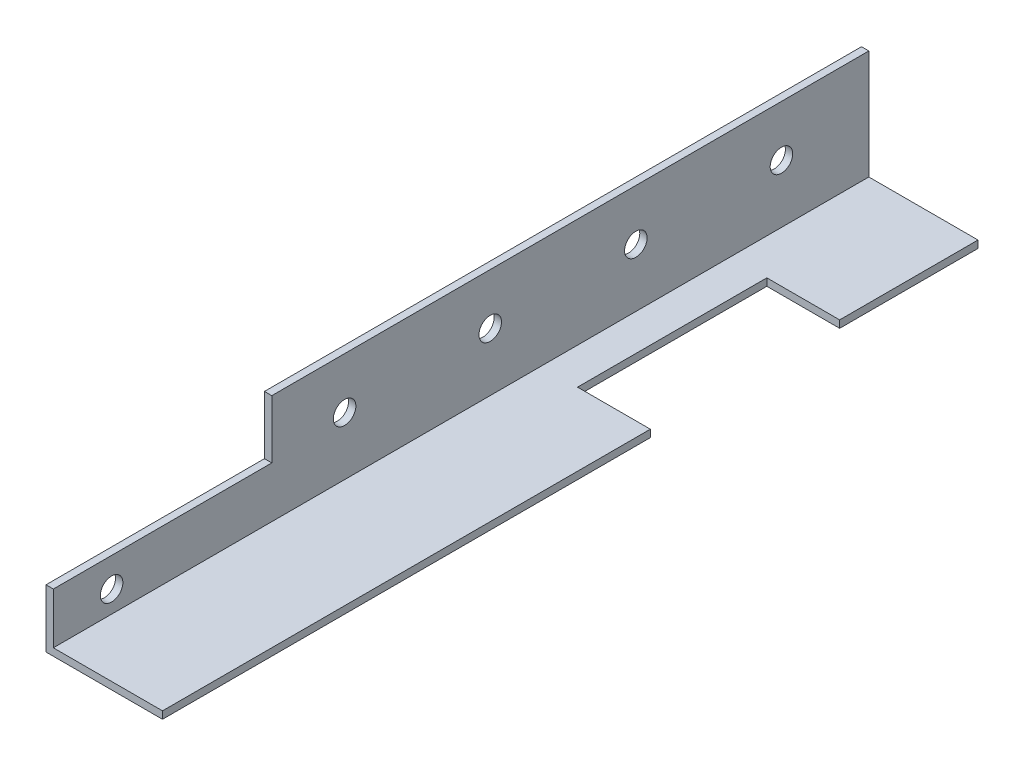
ISO-10303-21;
HEADER;
FILE_DESCRIPTION(('STEP AP214'),'2;1');
FILE_NAME('part.step','',(''),(''),'','','');
FILE_SCHEMA(('AUTOMOTIVE_DESIGN { 1 0 10303 214 1 1 1 1 }'));
ENDSEC;
DATA;
#1=APPLICATION_CONTEXT('core data for automotive mechanical design processes');
#2=APPLICATION_PROTOCOL_DEFINITION('international standard','automotive_design',2000,#1);
#3=PRODUCT_CONTEXT('',#1,'mechanical');
#4=PRODUCT('Part','Part','',(#3));
#5=PRODUCT_RELATED_PRODUCT_CATEGORY('part','',(#4));
#6=PRODUCT_DEFINITION_FORMATION('','',#4);
#7=PRODUCT_DEFINITION_CONTEXT('part definition',#1,'design');
#8=PRODUCT_DEFINITION('design','',#6,#7);
#9=PRODUCT_DEFINITION_SHAPE('','',#8);
#10=(LENGTH_UNIT() NAMED_UNIT(*) SI_UNIT(.MILLI.,.METRE.));
#11=(NAMED_UNIT(*) PLANE_ANGLE_UNIT() SI_UNIT($,.RADIAN.));
#12=(NAMED_UNIT(*) SI_UNIT($,.STERADIAN.) SOLID_ANGLE_UNIT());
#13=UNCERTAINTY_MEASURE_WITH_UNIT(LENGTH_MEASURE(1.E-05),#10,'distance_accuracy_value','');
#14=(GEOMETRIC_REPRESENTATION_CONTEXT(3) GLOBAL_UNCERTAINTY_ASSIGNED_CONTEXT((#13)) GLOBAL_UNIT_ASSIGNED_CONTEXT((#10,
#11,#12)) REPRESENTATION_CONTEXT('',''));
#15=CARTESIAN_POINT('',(0.,0.,0.));
#16=DIRECTION('',(0.,0.,1.));
#17=DIRECTION('',(1.,0.,0.));
#18=AXIS2_PLACEMENT_3D('',#15,#16,#17);
#19=CARTESIAN_POINT('',(25.4,1.6002,177.8));
#20=DIRECTION('',(1.,0.,0.));
#21=DIRECTION('',(0.,0.,-1.));
#22=AXIS2_PLACEMENT_3D('',#19,#20,#21);
#23=PLANE('',#22);
#24=DIRECTION('',(0.,1.,0.));
#25=VECTOR('',#24,1.);
#26=CARTESIAN_POINT('',(25.4,0.,71.4375));
#27=LINE('',#26,#25);
#28=CARTESIAN_POINT('',(25.4,0.,71.4375));
#29=VERTEX_POINT('',#28);
#30=CARTESIAN_POINT('',(25.4,1.6002,71.4375));
#31=VERTEX_POINT('',#30);
#32=EDGE_CURVE('E171',#29,#31,#27,.T.);
#33=ORIENTED_EDGE('',*,*,#32,.T.);
#34=DIRECTION('',(0.,0.,-1.));
#35=VECTOR('',#34,1.);
#36=CARTESIAN_POINT('',(25.4,1.6002,177.8));
#37=LINE('',#36,#35);
#38=CARTESIAN_POINT('',(25.4,1.6002,177.8));
#39=VERTEX_POINT('',#38);
#40=EDGE_CURVE('E238',#39,#31,#37,.T.);
#41=ORIENTED_EDGE('',*,*,#40,.F.);
#42=DIRECTION('',(0.,-1.,0.));
#43=VECTOR('',#42,1.);
#44=CARTESIAN_POINT('',(25.4,1.6002,177.8));
#45=LINE('',#44,#43);
#46=CARTESIAN_POINT('',(25.4,0.,177.8));
#47=VERTEX_POINT('',#46);
#48=EDGE_CURVE('E210',#39,#47,#45,.T.);
#49=ORIENTED_EDGE('',*,*,#48,.T.);
#50=DIRECTION('',(0.,0.,-1.));
#51=VECTOR('',#50,1.);
#52=CARTESIAN_POINT('',(25.4,0.,177.8));
#53=LINE('',#52,#51);
#54=EDGE_CURVE('E234',#47,#29,#53,.T.);
#55=ORIENTED_EDGE('',*,*,#54,.T.);
#56=EDGE_LOOP('',(#33,#41,#49,#55));
#57=FACE_BOUND('',#56,.T.);
#58=ADVANCED_FACE('F34',(#57),#23,.T.);
#59=CARTESIAN_POINT('',(0.,25.4,177.8));
#60=DIRECTION('',(0.,1.,0.));
#61=DIRECTION('',(0.,0.,1.));
#62=AXIS2_PLACEMENT_3D('',#59,#60,#61);
#63=PLANE('',#62);
#64=DIRECTION('',(1.,0.,0.));
#65=VECTOR('',#64,1.);
#66=CARTESIAN_POINT('',(0.,25.4,130.175));
#67=LINE('',#66,#65);
#68=CARTESIAN_POINT('',(0.,25.4,130.175));
#69=VERTEX_POINT('',#68);
#70=CARTESIAN_POINT('',(1.6002,25.4,130.175));
#71=VERTEX_POINT('',#70);
#72=EDGE_CURVE('E130',#69,#71,#67,.T.);
#73=ORIENTED_EDGE('',*,*,#72,.T.);
#74=DIRECTION('',(0.,0.,-1.));
#75=VECTOR('',#74,1.);
#76=CARTESIAN_POINT('',(1.6002,25.4,177.8));
#77=LINE('',#76,#75);
#78=CARTESIAN_POINT('',(1.6002,25.4,0.));
#79=VERTEX_POINT('',#78);
#80=EDGE_CURVE('E38',#71,#79,#77,.T.);
#81=ORIENTED_EDGE('',*,*,#80,.T.);
#82=DIRECTION('',(1.,0.,0.));
#83=VECTOR('',#82,1.);
#84=CARTESIAN_POINT('',(0.,25.4,0.));
#85=LINE('',#84,#83);
#86=CARTESIAN_POINT('',(0.,25.4,0.));
#87=VERTEX_POINT('',#86);
#88=EDGE_CURVE('E203',#87,#79,#85,.T.);
#89=ORIENTED_EDGE('',*,*,#88,.F.);
#90=DIRECTION('',(0.,0.,-1.));
#91=VECTOR('',#90,1.);
#92=CARTESIAN_POINT('',(0.,25.4,177.8));
#93=LINE('',#92,#91);
#94=EDGE_CURVE('E11',#69,#87,#93,.T.);
#95=ORIENTED_EDGE('',*,*,#94,.F.);
#96=EDGE_LOOP('',(#73,#81,#89,#95));
#97=FACE_BOUND('',#96,.T.);
#98=ADVANCED_FACE('F36',(#97),#63,.T.);
#99=CARTESIAN_POINT('',(0.,0.,177.8));
#100=DIRECTION('',(-1.,0.,0.));
#101=DIRECTION('',(0.,0.,1.));
#102=AXIS2_PLACEMENT_3D('',#99,#100,#101);
#103=PLANE('',#102);
#104=CARTESIAN_POINT('',(0.,6.35,165.1));
#105=DIRECTION('',(1.,0.,0.));
#106=DIRECTION('',(0.,0.,-1.));
#107=AXIS2_PLACEMENT_3D('',#104,#105,#106);
#108=CIRCLE('',#107,2.45745);
#109=CARTESIAN_POINT('',(0.,6.35,162.64255));
#110=VERTEX_POINT('',#109);
#111=EDGE_CURVE('E149',#110,#110,#108,.T.);
#112=ORIENTED_EDGE('',*,*,#111,.T.);
#113=EDGE_LOOP('',(#112));
#114=FACE_BOUND('',#113,.T.);
#115=DIRECTION('',(0.,1.,0.));
#116=VECTOR('',#115,1.);
#117=CARTESIAN_POINT('',(0.,25.4,130.175));
#118=LINE('',#117,#116);
#119=CARTESIAN_POINT('',(0.,12.7,130.175));
#120=VERTEX_POINT('',#119);
#121=EDGE_CURVE('E134',#120,#69,#118,.T.);
#122=ORIENTED_EDGE('',*,*,#121,.T.);
#123=ORIENTED_EDGE('',*,*,#94,.T.);
#124=DIRECTION('',(0.,1.,0.));
#125=VECTOR('',#124,1.);
#126=CARTESIAN_POINT('',(0.,0.,0.));
#127=LINE('',#126,#125);
#128=CARTESIAN_POINT('',(0.,0.,0.));
#129=VERTEX_POINT('',#128);
#130=EDGE_CURVE('E207',#129,#87,#127,.T.);
#131=ORIENTED_EDGE('',*,*,#130,.F.);
#132=DIRECTION('',(0.,0.,-1.));
#133=VECTOR('',#132,1.);
#134=CARTESIAN_POINT('',(0.,0.,177.8));
#135=LINE('',#134,#133);
#136=CARTESIAN_POINT('',(0.,0.,177.8));
#137=VERTEX_POINT('',#136);
#138=EDGE_CURVE('E43',#137,#129,#135,.T.);
#139=ORIENTED_EDGE('',*,*,#138,.F.);
#140=DIRECTION('',(0.,1.,0.));
#141=VECTOR('',#140,1.);
#142=CARTESIAN_POINT('',(0.,0.,177.8));
#143=LINE('',#142,#141);
#144=CARTESIAN_POINT('',(0.,12.7,177.8));
#145=VERTEX_POINT('',#144);
#146=EDGE_CURVE('E144',#137,#145,#143,.T.);
#147=ORIENTED_EDGE('',*,*,#146,.T.);
#148=DIRECTION('',(0.,0.,-1.));
#149=VECTOR('',#148,1.);
#150=CARTESIAN_POINT('',(0.,12.7,177.8));
#151=LINE('',#150,#149);
#152=EDGE_CURVE('E51',#145,#120,#151,.T.);
#153=ORIENTED_EDGE('',*,*,#152,.T.);
#154=EDGE_LOOP('',(#122,#123,#131,#139,#147,#153));
#155=FACE_BOUND('',#154,.T.);
#156=CARTESIAN_POINT('',(0.,14.2875,82.55));
#157=DIRECTION('',(1.,0.,0.));
#158=DIRECTION('',(0.,0.,-1.));
#159=AXIS2_PLACEMENT_3D('',#156,#157,#158);
#160=CIRCLE('',#159,2.45745);
#161=CARTESIAN_POINT('',(0.,14.2875,80.09255));
#162=VERTEX_POINT('',#161);
#163=EDGE_CURVE('E182',#162,#162,#160,.T.);
#164=ORIENTED_EDGE('',*,*,#163,.T.);
#165=EDGE_LOOP('',(#164));
#166=FACE_BOUND('',#165,.T.);
#167=CARTESIAN_POINT('',(0.,14.2875,50.8));
#168=DIRECTION('',(1.,0.,0.));
#169=DIRECTION('',(0.,0.,-1.));
#170=AXIS2_PLACEMENT_3D('',#167,#168,#169);
#171=CIRCLE('',#170,2.45745);
#172=CARTESIAN_POINT('',(0.,14.2875,48.34255));
#173=VERTEX_POINT('',#172);
#174=EDGE_CURVE('E188',#173,#173,#171,.T.);
#175=ORIENTED_EDGE('',*,*,#174,.T.);
#176=EDGE_LOOP('',(#175));
#177=FACE_BOUND('',#176,.T.);
#178=CARTESIAN_POINT('',(0.,14.2875,19.05));
#179=DIRECTION('',(1.,0.,0.));
#180=DIRECTION('',(0.,0.,-1.));
#181=AXIS2_PLACEMENT_3D('',#178,#179,#180);
#182=CIRCLE('',#181,2.45745);
#183=CARTESIAN_POINT('',(0.,14.2875,16.59255));
#184=VERTEX_POINT('',#183);
#185=EDGE_CURVE('E194',#184,#184,#182,.T.);
#186=ORIENTED_EDGE('',*,*,#185,.T.);
#187=EDGE_LOOP('',(#186));
#188=FACE_BOUND('',#187,.T.);
#189=CARTESIAN_POINT('',(0.,14.2875,114.3));
#190=DIRECTION('',(1.,0.,0.));
#191=DIRECTION('',(0.,0.,-1.));
#192=AXIS2_PLACEMENT_3D('',#189,#190,#191);
#193=CIRCLE('',#192,2.45745);
#194=CARTESIAN_POINT('',(0.,14.2875,111.84255));
#195=VERTEX_POINT('',#194);
#196=EDGE_CURVE('E200',#195,#195,#193,.T.);
#197=ORIENTED_EDGE('',*,*,#196,.T.);
#198=EDGE_LOOP('',(#197));
#199=FACE_BOUND('',#198,.T.);
#200=ADVANCED_FACE('F141',(#114,#155,#166,#177,#188,#199),#103,.T.);
#201=CARTESIAN_POINT('',(25.4,0.,177.8));
#202=DIRECTION('',(0.,-1.,0.));
#203=DIRECTION('',(1.,0.,0.));
#204=AXIS2_PLACEMENT_3D('',#201,#202,#203);
#205=PLANE('',#204);
#206=DIRECTION('',(1.,0.,0.));
#207=VECTOR('',#206,1.);
#208=CARTESIAN_POINT('',(9.525,0.,71.4375));
#209=LINE('',#208,#207);
#210=CARTESIAN_POINT('',(9.525,0.,71.4375));
#211=VERTEX_POINT('',#210);
#212=EDGE_CURVE('E163',#211,#29,#209,.T.);
#213=ORIENTED_EDGE('',*,*,#212,.T.);
#214=ORIENTED_EDGE('',*,*,#54,.F.);
#215=DIRECTION('',(-1.,0.,0.));
#216=VECTOR('',#215,1.);
#217=CARTESIAN_POINT('',(25.4,0.,177.8));
#218=LINE('',#217,#216);
#219=EDGE_CURVE('E213',#47,#137,#218,.T.);
#220=ORIENTED_EDGE('',*,*,#219,.T.);
#221=ORIENTED_EDGE('',*,*,#138,.T.);
#222=DIRECTION('',(-1.,0.,0.));
#223=VECTOR('',#222,1.);
#224=CARTESIAN_POINT('',(25.4,0.,0.));
#225=LINE('',#224,#223);
#226=CARTESIAN_POINT('',(25.4,0.,0.));
#227=VERTEX_POINT('',#226);
#228=EDGE_CURVE('E228',#227,#129,#225,.T.);
#229=ORIENTED_EDGE('',*,*,#228,.F.);
#230=CARTESIAN_POINT('',(25.4,0.,30.1625));
#231=VERTEX_POINT('',#230);
#232=EDGE_CURVE('E237',#231,#227,#53,.T.);
#233=ORIENTED_EDGE('',*,*,#232,.F.);
#234=DIRECTION('',(-1.,0.,0.));
#235=VECTOR('',#234,1.);
#236=CARTESIAN_POINT('',(9.525,0.,30.1625));
#237=LINE('',#236,#235);
#238=CARTESIAN_POINT('',(9.525,0.,30.1625));
#239=VERTEX_POINT('',#238);
#240=EDGE_CURVE('E156',#231,#239,#237,.T.);
#241=ORIENTED_EDGE('',*,*,#240,.T.);
#242=DIRECTION('',(0.,0.,1.));
#243=VECTOR('',#242,1.);
#244=CARTESIAN_POINT('',(9.525,0.,30.1625));
#245=LINE('',#244,#243);
#246=EDGE_CURVE('E159',#239,#211,#245,.T.);
#247=ORIENTED_EDGE('',*,*,#246,.T.);
#248=EDGE_LOOP('',(#213,#214,#220,#221,#229,#233,#241,#247));
#249=FACE_BOUND('',#248,.T.);
#250=ADVANCED_FACE('F257',(#249),#205,.T.);
#251=DIRECTION('',(0.,1.,0.));
#252=VECTOR('',#251,1.);
#253=CARTESIAN_POINT('',(25.4,0.,30.1625));
#254=LINE('',#253,#252);
#255=CARTESIAN_POINT('',(25.4,1.6002,30.1625));
#256=VERTEX_POINT('',#255);
#257=EDGE_CURVE('E59',#231,#256,#254,.T.);
#258=ORIENTED_EDGE('',*,*,#257,.F.);
#259=ORIENTED_EDGE('',*,*,#232,.T.);
#260=DIRECTION('',(0.,-1.,0.));
#261=VECTOR('',#260,1.);
#262=CARTESIAN_POINT('',(25.4,1.6002,0.));
#263=LINE('',#262,#261);
#264=CARTESIAN_POINT('',(25.4,1.6002,0.));
#265=VERTEX_POINT('',#264);
#266=EDGE_CURVE('E225',#265,#227,#263,.T.);
#267=ORIENTED_EDGE('',*,*,#266,.F.);
#268=EDGE_CURVE('E240',#256,#265,#37,.T.);
#269=ORIENTED_EDGE('',*,*,#268,.F.);
#270=EDGE_LOOP('',(#258,#259,#267,#269));
#271=FACE_BOUND('',#270,.T.);
#272=ADVANCED_FACE('F278',(#271),#23,.T.);
#273=CARTESIAN_POINT('',(1.6002,1.6002,177.8));
#274=DIRECTION('',(0.,1.,0.));
#275=DIRECTION('',(-1.,0.,0.));
#276=AXIS2_PLACEMENT_3D('',#273,#274,#275);
#277=PLANE('',#276);
#278=DIRECTION('',(1.,0.,0.));
#279=VECTOR('',#278,1.);
#280=CARTESIAN_POINT('',(9.525,1.6002,71.4375));
#281=LINE('',#280,#279);
#282=CARTESIAN_POINT('',(9.525,1.6002,71.4375));
#283=VERTEX_POINT('',#282);
#284=EDGE_CURVE('E160',#283,#31,#281,.T.);
#285=ORIENTED_EDGE('',*,*,#284,.F.);
#286=DIRECTION('',(0.,0.,1.));
#287=VECTOR('',#286,1.);
#288=CARTESIAN_POINT('',(9.525,1.6002,30.1625));
#289=LINE('',#288,#287);
#290=CARTESIAN_POINT('',(9.525,1.6002,30.1625));
#291=VERTEX_POINT('',#290);
#292=EDGE_CURVE('E167',#291,#283,#289,.T.);
#293=ORIENTED_EDGE('',*,*,#292,.F.);
#294=DIRECTION('',(-1.,0.,0.));
#295=VECTOR('',#294,1.);
#296=CARTESIAN_POINT('',(9.525,1.6002,30.1625));
#297=LINE('',#296,#295);
#298=EDGE_CURVE('E153',#256,#291,#297,.T.);
#299=ORIENTED_EDGE('',*,*,#298,.F.);
#300=ORIENTED_EDGE('',*,*,#268,.T.);
#301=DIRECTION('',(1.,0.,0.));
#302=VECTOR('',#301,1.);
#303=CARTESIAN_POINT('',(1.6002,1.6002,0.));
#304=LINE('',#303,#302);
#305=CARTESIAN_POINT('',(1.6002,1.6002,0.));
#306=VERTEX_POINT('',#305);
#307=EDGE_CURVE('E222',#306,#265,#304,.T.);
#308=ORIENTED_EDGE('',*,*,#307,.F.);
#309=DIRECTION('',(0.,0.,-1.));
#310=VECTOR('',#309,1.);
#311=CARTESIAN_POINT('',(1.6002,1.6002,177.8));
#312=LINE('',#311,#310);
#313=CARTESIAN_POINT('',(1.6002,1.6002,177.8));
#314=VERTEX_POINT('',#313);
#315=EDGE_CURVE('E241',#314,#306,#312,.T.);
#316=ORIENTED_EDGE('',*,*,#315,.F.);
#317=DIRECTION('',(1.,0.,0.));
#318=VECTOR('',#317,1.);
#319=CARTESIAN_POINT('',(1.6002,1.6002,177.8));
#320=LINE('',#319,#318);
#321=EDGE_CURVE('E206',#314,#39,#320,.T.);
#322=ORIENTED_EDGE('',*,*,#321,.T.);
#323=ORIENTED_EDGE('',*,*,#40,.T.);
#324=EDGE_LOOP('',(#285,#293,#299,#300,#308,#316,#322,#323));
#325=FACE_BOUND('',#324,.T.);
#326=ADVANCED_FACE('F265',(#325),#277,.T.);
#327=CARTESIAN_POINT('',(1.6002,25.4,177.8));
#328=DIRECTION('',(1.,0.,0.));
#329=DIRECTION('',(0.,1.,0.));
#330=AXIS2_PLACEMENT_3D('',#327,#328,#329);
#331=PLANE('',#330);
#332=CARTESIAN_POINT('',(1.6002,6.35,165.1));
#333=DIRECTION('',(1.,0.,0.));
#334=DIRECTION('',(0.,0.,-1.));
#335=AXIS2_PLACEMENT_3D('',#332,#333,#334);
#336=CIRCLE('',#335,2.45744999999999);
#337=CARTESIAN_POINT('',(1.6002,6.35,162.64255));
#338=VERTEX_POINT('',#337);
#339=EDGE_CURVE('E340',#338,#338,#336,.T.);
#340=ORIENTED_EDGE('',*,*,#339,.F.);
#341=EDGE_LOOP('',(#340));
#342=FACE_BOUND('',#341,.T.);
#343=DIRECTION('',(0.,1.,0.));
#344=VECTOR('',#343,1.);
#345=CARTESIAN_POINT('',(1.6002,25.4,130.175));
#346=LINE('',#345,#344);
#347=CARTESIAN_POINT('',(1.6002,12.7,130.175));
#348=VERTEX_POINT('',#347);
#349=EDGE_CURVE('E145',#348,#71,#346,.T.);
#350=ORIENTED_EDGE('',*,*,#349,.F.);
#351=DIRECTION('',(0.,0.,-1.));
#352=VECTOR('',#351,1.);
#353=CARTESIAN_POINT('',(1.6002,12.7,177.8));
#354=LINE('',#353,#352);
#355=CARTESIAN_POINT('',(1.6002,12.7,177.8));
#356=VERTEX_POINT('',#355);
#357=EDGE_CURVE('E127',#356,#348,#354,.T.);
#358=ORIENTED_EDGE('',*,*,#357,.F.);
#359=DIRECTION('',(0.,-1.,0.));
#360=VECTOR('',#359,1.);
#361=CARTESIAN_POINT('',(1.6002,25.4,177.8));
#362=LINE('',#361,#360);
#363=EDGE_CURVE('E204',#356,#314,#362,.T.);
#364=ORIENTED_EDGE('',*,*,#363,.T.);
#365=ORIENTED_EDGE('',*,*,#315,.T.);
#366=DIRECTION('',(0.,-1.,0.));
#367=VECTOR('',#366,1.);
#368=CARTESIAN_POINT('',(1.6002,25.4,0.));
#369=LINE('',#368,#367);
#370=EDGE_CURVE('E219',#79,#306,#369,.T.);
#371=ORIENTED_EDGE('',*,*,#370,.F.);
#372=ORIENTED_EDGE('',*,*,#80,.F.);
#373=EDGE_LOOP('',(#350,#358,#364,#365,#371,#372));
#374=FACE_BOUND('',#373,.T.);
#375=CARTESIAN_POINT('',(1.6002,14.2875,82.55));
#376=DIRECTION('',(1.,0.,0.));
#377=DIRECTION('',(0.,0.,-1.));
#378=AXIS2_PLACEMENT_3D('',#375,#376,#377);
#379=CIRCLE('',#378,2.45744999999999);
#380=CARTESIAN_POINT('',(1.6002,14.2875,80.09255));
#381=VERTEX_POINT('',#380);
#382=EDGE_CURVE('E174',#381,#381,#379,.T.);
#383=ORIENTED_EDGE('',*,*,#382,.F.);
#384=EDGE_LOOP('',(#383));
#385=FACE_BOUND('',#384,.T.);
#386=CARTESIAN_POINT('',(1.6002,14.2875,50.8));
#387=DIRECTION('',(1.,0.,0.));
#388=DIRECTION('',(0.,0.,-1.));
#389=AXIS2_PLACEMENT_3D('',#386,#387,#388);
#390=CIRCLE('',#389,2.45744999999999);
#391=CARTESIAN_POINT('',(1.6002,14.2875,48.34255));
#392=VERTEX_POINT('',#391);
#393=EDGE_CURVE('E185',#392,#392,#390,.T.);
#394=ORIENTED_EDGE('',*,*,#393,.F.);
#395=EDGE_LOOP('',(#394));
#396=FACE_BOUND('',#395,.T.);
#397=CARTESIAN_POINT('',(1.6002,14.2875,19.05));
#398=DIRECTION('',(1.,0.,0.));
#399=DIRECTION('',(0.,0.,-1.));
#400=AXIS2_PLACEMENT_3D('',#397,#398,#399);
#401=CIRCLE('',#400,2.45744999999999);
#402=CARTESIAN_POINT('',(1.6002,14.2875,16.59255));
#403=VERTEX_POINT('',#402);
#404=EDGE_CURVE('E191',#403,#403,#401,.T.);
#405=ORIENTED_EDGE('',*,*,#404,.F.);
#406=EDGE_LOOP('',(#405));
#407=FACE_BOUND('',#406,.T.);
#408=CARTESIAN_POINT('',(1.6002,14.2875,114.3));
#409=DIRECTION('',(1.,0.,0.));
#410=DIRECTION('',(0.,0.,-1.));
#411=AXIS2_PLACEMENT_3D('',#408,#409,#410);
#412=CIRCLE('',#411,2.45744999999999);
#413=CARTESIAN_POINT('',(1.6002,14.2875,111.84255));
#414=VERTEX_POINT('',#413);
#415=EDGE_CURVE('E197',#414,#414,#412,.T.);
#416=ORIENTED_EDGE('',*,*,#415,.F.);
#417=EDGE_LOOP('',(#416));
#418=FACE_BOUND('',#417,.T.);
#419=ADVANCED_FACE('F249',(#342,#374,#385,#396,#407,#418),#331,.T.);
#420=CARTESIAN_POINT('',(0.,0.,177.8));
#421=DIRECTION('',(0.,0.,-1.));
#422=DIRECTION('',(-1.,0.,0.));
#423=AXIS2_PLACEMENT_3D('',#420,#421,#422);
#424=PLANE('',#423);
#425=ORIENTED_EDGE('',*,*,#363,.F.);
#426=DIRECTION('',(1.,0.,0.));
#427=VECTOR('',#426,1.);
#428=CARTESIAN_POINT('',(0.,12.7,177.8));
#429=LINE('',#428,#427);
#430=EDGE_CURVE('E131',#145,#356,#429,.T.);
#431=ORIENTED_EDGE('',*,*,#430,.F.);
#432=ORIENTED_EDGE('',*,*,#146,.F.);
#433=ORIENTED_EDGE('',*,*,#219,.F.);
#434=ORIENTED_EDGE('',*,*,#48,.F.);
#435=ORIENTED_EDGE('',*,*,#321,.F.);
#436=EDGE_LOOP('',(#425,#431,#432,#433,#434,#435));
#437=FACE_BOUND('',#436,.T.);
#438=ADVANCED_FACE('F261',(#437),#424,.F.);
#439=CARTESIAN_POINT('',(0.,0.,0.));
#440=DIRECTION('',(0.,0.,-1.));
#441=DIRECTION('',(-1.,0.,0.));
#442=AXIS2_PLACEMENT_3D('',#439,#440,#441);
#443=PLANE('',#442);
#444=ORIENTED_EDGE('',*,*,#88,.T.);
#445=ORIENTED_EDGE('',*,*,#370,.T.);
#446=ORIENTED_EDGE('',*,*,#307,.T.);
#447=ORIENTED_EDGE('',*,*,#266,.T.);
#448=ORIENTED_EDGE('',*,*,#228,.T.);
#449=ORIENTED_EDGE('',*,*,#130,.T.);
#450=EDGE_LOOP('',(#444,#445,#446,#447,#448,#449));
#451=FACE_BOUND('',#450,.T.);
#452=ADVANCED_FACE('F252',(#451),#443,.T.);
#453=CARTESIAN_POINT('',(1.6002,14.2875,114.3));
#454=DIRECTION('',(1.,0.,0.));
#455=DIRECTION('',(0.,0.,-1.));
#456=AXIS2_PLACEMENT_3D('',#453,#454,#455);
#457=CYLINDRICAL_SURFACE('',#456,2.45744999999999);
#458=ORIENTED_EDGE('',*,*,#196,.F.);
#459=EDGE_LOOP('',(#458));
#460=FACE_BOUND('',#459,.T.);
#461=ORIENTED_EDGE('',*,*,#415,.T.);
#462=EDGE_LOOP('',(#461));
#463=FACE_BOUND('',#462,.T.);
#464=ADVANCED_FACE('F303',(#460,#463),#457,.F.);
#465=CARTESIAN_POINT('',(1.6002,14.2875,19.05));
#466=DIRECTION('',(1.,0.,0.));
#467=DIRECTION('',(0.,0.,-1.));
#468=AXIS2_PLACEMENT_3D('',#465,#466,#467);
#469=CYLINDRICAL_SURFACE('',#468,2.45744999999999);
#470=ORIENTED_EDGE('',*,*,#185,.F.);
#471=EDGE_LOOP('',(#470));
#472=FACE_BOUND('',#471,.T.);
#473=ORIENTED_EDGE('',*,*,#404,.T.);
#474=EDGE_LOOP('',(#473));
#475=FACE_BOUND('',#474,.T.);
#476=ADVANCED_FACE('F308',(#472,#475),#469,.F.);
#477=CARTESIAN_POINT('',(1.6002,14.2875,50.8));
#478=DIRECTION('',(1.,0.,0.));
#479=DIRECTION('',(0.,0.,-1.));
#480=AXIS2_PLACEMENT_3D('',#477,#478,#479);
#481=CYLINDRICAL_SURFACE('',#480,2.45744999999999);
#482=ORIENTED_EDGE('',*,*,#174,.F.);
#483=EDGE_LOOP('',(#482));
#484=FACE_BOUND('',#483,.T.);
#485=ORIENTED_EDGE('',*,*,#393,.T.);
#486=EDGE_LOOP('',(#485));
#487=FACE_BOUND('',#486,.T.);
#488=ADVANCED_FACE('F312',(#484,#487),#481,.F.);
#489=CARTESIAN_POINT('',(1.6002,14.2875,82.55));
#490=DIRECTION('',(1.,0.,0.));
#491=DIRECTION('',(0.,0.,-1.));
#492=AXIS2_PLACEMENT_3D('',#489,#490,#491);
#493=CYLINDRICAL_SURFACE('',#492,2.45744999999999);
#494=ORIENTED_EDGE('',*,*,#163,.F.);
#495=EDGE_LOOP('',(#494));
#496=FACE_BOUND('',#495,.T.);
#497=ORIENTED_EDGE('',*,*,#382,.T.);
#498=EDGE_LOOP('',(#497));
#499=FACE_BOUND('',#498,.T.);
#500=ADVANCED_FACE('F316',(#496,#499),#493,.F.);
#501=CARTESIAN_POINT('',(9.525,0.,71.4375));
#502=DIRECTION('',(0.,0.,1.));
#503=DIRECTION('',(1.,0.,0.));
#504=AXIS2_PLACEMENT_3D('',#501,#502,#503);
#505=PLANE('',#504);
#506=ORIENTED_EDGE('',*,*,#284,.T.);
#507=ORIENTED_EDGE('',*,*,#32,.F.);
#508=ORIENTED_EDGE('',*,*,#212,.F.);
#509=DIRECTION('',(0.,1.,0.));
#510=VECTOR('',#509,1.);
#511=CARTESIAN_POINT('',(9.525,0.,71.4375));
#512=LINE('',#511,#510);
#513=EDGE_CURVE('E175',#211,#283,#512,.T.);
#514=ORIENTED_EDGE('',*,*,#513,.T.);
#515=EDGE_LOOP('',(#506,#507,#508,#514));
#516=FACE_BOUND('',#515,.T.);
#517=ADVANCED_FACE('F269',(#516),#505,.F.);
#518=CARTESIAN_POINT('',(9.525,0.,30.1625));
#519=DIRECTION('',(-1.,0.,0.));
#520=DIRECTION('',(0.,0.,1.));
#521=AXIS2_PLACEMENT_3D('',#518,#519,#520);
#522=PLANE('',#521);
#523=ORIENTED_EDGE('',*,*,#292,.T.);
#524=ORIENTED_EDGE('',*,*,#513,.F.);
#525=ORIENTED_EDGE('',*,*,#246,.F.);
#526=DIRECTION('',(0.,1.,0.));
#527=VECTOR('',#526,1.);
#528=CARTESIAN_POINT('',(9.525,0.,30.1625));
#529=LINE('',#528,#527);
#530=EDGE_CURVE('E177',#239,#291,#529,.T.);
#531=ORIENTED_EDGE('',*,*,#530,.T.);
#532=EDGE_LOOP('',(#523,#524,#525,#531));
#533=FACE_BOUND('',#532,.T.);
#534=ADVANCED_FACE('F273',(#533),#522,.F.);
#535=CARTESIAN_POINT('',(9.525,0.,30.1625));
#536=DIRECTION('',(0.,0.,-1.));
#537=DIRECTION('',(-1.,0.,0.));
#538=AXIS2_PLACEMENT_3D('',#535,#536,#537);
#539=PLANE('',#538);
#540=ORIENTED_EDGE('',*,*,#298,.T.);
#541=ORIENTED_EDGE('',*,*,#530,.F.);
#542=ORIENTED_EDGE('',*,*,#240,.F.);
#543=ORIENTED_EDGE('',*,*,#257,.T.);
#544=EDGE_LOOP('',(#540,#541,#542,#543));
#545=FACE_BOUND('',#544,.T.);
#546=ADVANCED_FACE('F274',(#545),#539,.F.);
#547=CARTESIAN_POINT('',(0.,25.4,130.175));
#548=DIRECTION('',(0.,0.,-1.));
#549=DIRECTION('',(-1.,0.,0.));
#550=AXIS2_PLACEMENT_3D('',#547,#548,#549);
#551=PLANE('',#550);
#552=ORIENTED_EDGE('',*,*,#349,.T.);
#553=ORIENTED_EDGE('',*,*,#72,.F.);
#554=ORIENTED_EDGE('',*,*,#121,.F.);
#555=DIRECTION('',(1.,0.,0.));
#556=VECTOR('',#555,1.);
#557=CARTESIAN_POINT('',(0.,12.7,130.175));
#558=LINE('',#557,#556);
#559=EDGE_CURVE('E123',#120,#348,#558,.T.);
#560=ORIENTED_EDGE('',*,*,#559,.T.);
#561=EDGE_LOOP('',(#552,#553,#554,#560));
#562=FACE_BOUND('',#561,.T.);
#563=ADVANCED_FACE('F135',(#562),#551,.F.);
#564=CARTESIAN_POINT('',(0.,12.7,177.8));
#565=DIRECTION('',(0.,-1.,0.));
#566=DIRECTION('',(1.,0.,0.));
#567=AXIS2_PLACEMENT_3D('',#564,#565,#566);
#568=PLANE('',#567);
#569=ORIENTED_EDGE('',*,*,#357,.T.);
#570=ORIENTED_EDGE('',*,*,#559,.F.);
#571=ORIENTED_EDGE('',*,*,#152,.F.);
#572=ORIENTED_EDGE('',*,*,#430,.T.);
#573=EDGE_LOOP('',(#569,#570,#571,#572));
#574=FACE_BOUND('',#573,.T.);
#575=ADVANCED_FACE('F125',(#574),#568,.F.);
#576=CARTESIAN_POINT('',(1.6002,6.35,165.1));
#577=DIRECTION('',(1.,0.,0.));
#578=DIRECTION('',(0.,0.,-1.));
#579=AXIS2_PLACEMENT_3D('',#576,#577,#578);
#580=CYLINDRICAL_SURFACE('',#579,2.45744999999999);
#581=ORIENTED_EDGE('',*,*,#111,.F.);
#582=EDGE_LOOP('',(#581));
#583=FACE_BOUND('',#582,.T.);
#584=ORIENTED_EDGE('',*,*,#339,.T.);
#585=EDGE_LOOP('',(#584));
#586=FACE_BOUND('',#585,.T.);
#587=ADVANCED_FACE('F329',(#583,#586),#580,.F.);
#588=CLOSED_SHELL('',(#58,#98,#200,#250,#272,#326,#419,#438,#452,#464,#476,#488,#500,#517,#534,
#546,#563,#575,#587));
#589=MANIFOLD_SOLID_BREP('B2',#588);
#590=ADVANCED_BREP_SHAPE_REPRESENTATION('',(#18,#589),#14);
#591=SHAPE_DEFINITION_REPRESENTATION(#9,#590);
ENDSEC;
END-ISO-10303-21;
